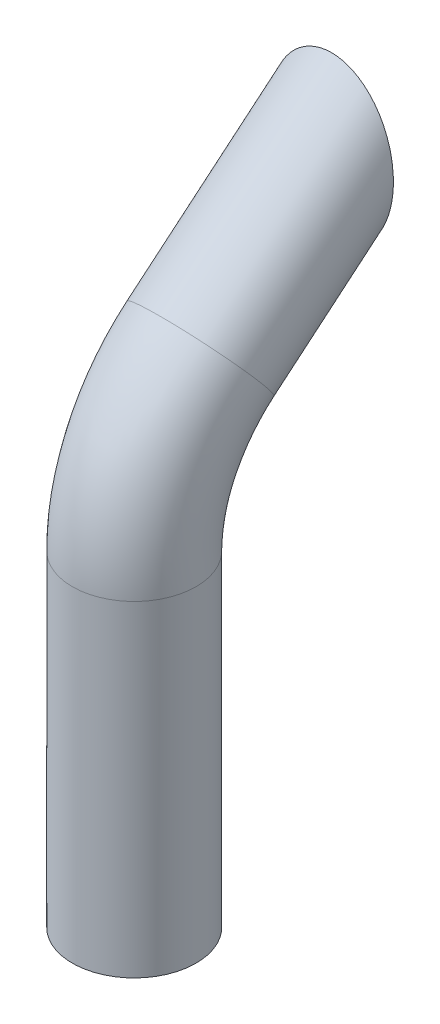
ISO-10303-21;
HEADER;
FILE_DESCRIPTION(('STEP AP214'),'2;1');
FILE_NAME('part.step','',(''),(''),'','','');
FILE_SCHEMA(('AUTOMOTIVE_DESIGN { 1 0 10303 214 1 1 1 1 }'));
ENDSEC;
DATA;
#1=APPLICATION_CONTEXT('core data for automotive mechanical design processes');
#2=APPLICATION_PROTOCOL_DEFINITION('international standard','automotive_design',2000,#1);
#3=PRODUCT_CONTEXT('',#1,'mechanical');
#4=PRODUCT('Part','Part','',(#3));
#5=PRODUCT_RELATED_PRODUCT_CATEGORY('part','',(#4));
#6=PRODUCT_DEFINITION_FORMATION('','',#4);
#7=PRODUCT_DEFINITION_CONTEXT('part definition',#1,'design');
#8=PRODUCT_DEFINITION('design','',#6,#7);
#9=PRODUCT_DEFINITION_SHAPE('','',#8);
#10=(LENGTH_UNIT() NAMED_UNIT(*) SI_UNIT(.MILLI.,.METRE.));
#11=(NAMED_UNIT(*) PLANE_ANGLE_UNIT() SI_UNIT($,.RADIAN.));
#12=(NAMED_UNIT(*) SI_UNIT($,.STERADIAN.) SOLID_ANGLE_UNIT());
#13=UNCERTAINTY_MEASURE_WITH_UNIT(LENGTH_MEASURE(1.E-05),#10,'distance_accuracy_value','');
#14=(GEOMETRIC_REPRESENTATION_CONTEXT(3) GLOBAL_UNCERTAINTY_ASSIGNED_CONTEXT((#13)) GLOBAL_UNIT_ASSIGNED_CONTEXT((#10,
#11,#12)) REPRESENTATION_CONTEXT('',''));
#15=CARTESIAN_POINT('',(0.,0.,0.));
#16=DIRECTION('',(0.,0.,1.));
#17=DIRECTION('',(1.,0.,0.));
#18=AXIS2_PLACEMENT_3D('',#15,#16,#17);
#19=CARTESIAN_POINT('',(0.,-296.418141452981,114.906666467847));
#20=DIRECTION('',(0.,-1.,0.));
#21=DIRECTION('',(0.,0.,-1.));
#22=AXIS2_PLACEMENT_3D('',#19,#20,#21);
#23=PLANE('',#22);
#24=CARTESIAN_POINT('',(0.,-296.418141452981,114.906666467847));
#25=DIRECTION('',(0.,-1.,0.));
#26=DIRECTION('',(0.,0.,-1.));
#27=AXIS2_PLACEMENT_3D('',#24,#25,#26);
#28=CIRCLE('',#27,27.);
#29=CARTESIAN_POINT('',(0.,-296.418141452981,87.9066664678468));
#30=VERTEX_POINT('',#29);
#31=EDGE_CURVE('E56',#30,#30,#28,.T.);
#32=ORIENTED_EDGE('',*,*,#31,.F.);
#33=EDGE_LOOP('',(#32));
#34=FACE_BOUND('',#33,.T.);
#35=CARTESIAN_POINT('',(0.,-296.418141452981,114.906666467847));
#36=DIRECTION('',(0.,-1.,0.));
#37=DIRECTION('',(0.,0.,-1.));
#38=AXIS2_PLACEMENT_3D('',#35,#36,#37);
#39=CIRCLE('',#38,30.);
#40=CARTESIAN_POINT('',(0.,-296.418141452981,84.9066664678468));
#41=VERTEX_POINT('',#40);
#42=EDGE_CURVE('E10',#41,#41,#39,.T.);
#43=ORIENTED_EDGE('',*,*,#42,.T.);
#44=EDGE_LOOP('',(#43));
#45=FACE_BOUND('',#44,.T.);
#46=ADVANCED_FACE('F37',(#34,#45),#23,.T.);
#47=CARTESIAN_POINT('',(0.,0.,0.));
#48=DIRECTION('',(0.,-0.642787609686538,0.766044443118979));
#49=DIRECTION('',(0.,-0.766044443118979,-0.642787609686538));
#50=AXIS2_PLACEMENT_3D('',#47,#48,#49);
#51=CYLINDRICAL_SURFACE('',#50,30.);
#52=CARTESIAN_POINT('',(0.,-16.1808853863989,19.2836282905961));
#53=DIRECTION('',(0.,0.,1.));
#54=DIRECTION('',(0.,-1.,0.));
#55=AXIS2_PLACEMENT_3D('',#52,#53,#54);
#56=ELLIPSE('',#55,39.1622186799683,30.);
#57=CARTESIAN_POINT('',(0.,-55.3431040663672,19.2836282905961));
#58=VERTEX_POINT('',#57);
#59=EDGE_CURVE('E68',#58,#58,#56,.F.);
#60=ORIENTED_EDGE('',*,*,#59,.F.);
#61=EDGE_LOOP('',(#60));
#62=FACE_BOUND('',#61,.T.);
#63=CARTESIAN_POINT('',(0.,-69.4418308062222,82.7575513396349));
#64=DIRECTION('',(0.,-0.642787609686538,0.766044443118979));
#65=DIRECTION('',(0.,-0.766044443118979,-0.642787609686538));
#66=AXIS2_PLACEMENT_3D('',#63,#64,#65);
#67=CIRCLE('',#66,30.);
#68=CARTESIAN_POINT('',(0.,-46.4604975126528,102.041179630231));
#69=VERTEX_POINT('',#68);
#70=EDGE_CURVE('E50',#69,#69,#67,.T.);
#71=ORIENTED_EDGE('',*,*,#70,.F.);
#72=EDGE_LOOP('',(#71));
#73=FACE_BOUND('',#72,.T.);
#74=ADVANCED_FACE('F99',(#62,#73),#51,.T.);
#75=CARTESIAN_POINT('',(0.,-138.385830686931,24.9066664678469));
#76=DIRECTION('',(1.,0.,0.));
#77=DIRECTION('',(0.,0.,-1.));
#78=AXIS2_PLACEMENT_3D('',#75,#76,#77);
#79=TOROIDAL_SURFACE('',#78,90.,30.);
#80=CARTESIAN_POINT('',(0.,-138.385830686931,114.906666467847));
#81=DIRECTION('',(0.,-1.,0.));
#82=DIRECTION('',(0.,0.,-1.));
#83=AXIS2_PLACEMENT_3D('',#80,#81,#82);
#84=CIRCLE('',#83,30.);
#85=CARTESIAN_POINT('',(0.,-138.385830686931,144.906666467847));
#86=VERTEX_POINT('',#85);
#87=EDGE_CURVE('E45',#86,#86,#84,.T.);
#88=CARTESIAN_POINT('',(0.,-138.385830686931,24.9066664678469));
#89=DIRECTION('',(1.,0.,0.));
#90=DIRECTION('',(0.,0.,-1.));
#91=AXIS2_PLACEMENT_3D('',#88,#89,#90);
#92=CIRCLE('',#91,120.);
#93=EDGE_CURVE('',#69,#86,#92,.T.);
#94=ORIENTED_EDGE('',*,*,#70,.T.);
#95=ORIENTED_EDGE('',*,*,#87,.F.);
#96=ORIENTED_EDGE('',*,*,#93,.T.);
#97=ORIENTED_EDGE('',*,*,#93,.F.);
#98=EDGE_LOOP('',(#94,#96,#95,#97));
#99=FACE_BOUND('',#98,.T.);
#100=ADVANCED_FACE('F94',(#99),#79,.T.);
#101=CARTESIAN_POINT('',(0.,-138.385830686931,114.906666467847));
#102=DIRECTION('',(0.,-1.,0.));
#103=DIRECTION('',(0.,0.,-1.));
#104=AXIS2_PLACEMENT_3D('',#101,#102,#103);
#105=CYLINDRICAL_SURFACE('',#104,30.);
#106=ORIENTED_EDGE('',*,*,#42,.F.);
#107=EDGE_LOOP('',(#106));
#108=FACE_BOUND('',#107,.T.);
#109=ORIENTED_EDGE('',*,*,#87,.T.);
#110=EDGE_LOOP('',(#109));
#111=FACE_BOUND('',#110,.T.);
#112=ADVANCED_FACE('F92',(#108,#111),#105,.T.);
#113=CARTESIAN_POINT('',(0.,0.,0.));
#114=DIRECTION('',(0.,-0.642787609686538,0.766044443118979));
#115=DIRECTION('',(0.,-0.766044443118979,-0.642787609686538));
#116=AXIS2_PLACEMENT_3D('',#113,#114,#115);
#117=CYLINDRICAL_SURFACE('',#116,27.);
#118=CARTESIAN_POINT('',(0.,-16.1808853863989,19.2836282905961));
#119=DIRECTION('',(0.,0.,1.));
#120=DIRECTION('',(0.,-1.,0.));
#121=AXIS2_PLACEMENT_3D('',#118,#119,#120);
#122=ELLIPSE('',#121,35.2459968119715,27.);
#123=CARTESIAN_POINT('',(0.,-51.4268821983704,19.2836282905961));
#124=VERTEX_POINT('',#123);
#125=EDGE_CURVE('E40',#124,#124,#122,.F.);
#126=ORIENTED_EDGE('',*,*,#125,.T.);
#127=EDGE_LOOP('',(#126));
#128=FACE_BOUND('',#127,.T.);
#129=CARTESIAN_POINT('',(0.,-69.4418308062223,82.757551339635));
#130=DIRECTION('',(0.,0.642787609686535,-0.766044443118982));
#131=DIRECTION('',(0.,0.766044443118982,0.642787609686535));
#132=AXIS2_PLACEMENT_3D('',#129,#130,#131);
#133=CIRCLE('',#132,27.);
#134=CARTESIAN_POINT('',(0.,-48.7586308420098,100.112816801171));
#135=VERTEX_POINT('',#134);
#136=EDGE_CURVE('E64',#135,#135,#133,.F.);
#137=ORIENTED_EDGE('',*,*,#136,.T.);
#138=EDGE_LOOP('',(#137));
#139=FACE_BOUND('',#138,.T.);
#140=ADVANCED_FACE('F77',(#128,#139),#117,.F.);
#141=CARTESIAN_POINT('',(0.,-138.385830686931,24.9066664678469));
#142=DIRECTION('',(1.,0.,0.));
#143=DIRECTION('',(0.,0.,-1.));
#144=AXIS2_PLACEMENT_3D('',#141,#142,#143);
#145=TOROIDAL_SURFACE('',#144,90.,27.);
#146=CARTESIAN_POINT('',(0.,-138.385830686931,114.906666467847));
#147=DIRECTION('',(0.,-1.,0.));
#148=DIRECTION('',(0.,0.,-1.));
#149=AXIS2_PLACEMENT_3D('',#146,#147,#148);
#150=CIRCLE('',#149,27.);
#151=CARTESIAN_POINT('',(0.,-138.385830686931,141.906666467847));
#152=VERTEX_POINT('',#151);
#153=EDGE_CURVE('E60',#152,#152,#150,.T.);
#154=CARTESIAN_POINT('',(0.,-138.385830686931,24.9066664678469));
#155=DIRECTION('',(1.,0.,0.));
#156=DIRECTION('',(0.,0.,-1.));
#157=AXIS2_PLACEMENT_3D('',#154,#155,#156);
#158=CIRCLE('',#157,117.);
#159=EDGE_CURVE('',#135,#152,#158,.T.);
#160=ORIENTED_EDGE('',*,*,#136,.F.);
#161=ORIENTED_EDGE('',*,*,#153,.T.);
#162=ORIENTED_EDGE('',*,*,#159,.T.);
#163=ORIENTED_EDGE('',*,*,#159,.F.);
#164=EDGE_LOOP('',(#160,#162,#161,#163));
#165=FACE_BOUND('',#164,.T.);
#166=ADVANCED_FACE('F87',(#165),#145,.F.);
#167=CARTESIAN_POINT('',(0.,-138.385830686931,114.906666467847));
#168=DIRECTION('',(0.,-1.,0.));
#169=DIRECTION('',(0.,0.,-1.));
#170=AXIS2_PLACEMENT_3D('',#167,#168,#169);
#171=CYLINDRICAL_SURFACE('',#170,27.);
#172=ORIENTED_EDGE('',*,*,#31,.T.);
#173=EDGE_LOOP('',(#172));
#174=FACE_BOUND('',#173,.T.);
#175=ORIENTED_EDGE('',*,*,#153,.F.);
#176=EDGE_LOOP('',(#175));
#177=FACE_BOUND('',#176,.T.);
#178=ADVANCED_FACE('F82',(#174,#177),#171,.F.);
#179=CARTESIAN_POINT('',(-45.,22.9813332935694,19.2836282905961));
#180=DIRECTION('',(0.,0.,1.));
#181=DIRECTION('',(1.,0.,0.));
#182=AXIS2_PLACEMENT_3D('',#179,#180,#181);
#183=PLANE('',#182);
#184=ORIENTED_EDGE('',*,*,#59,.T.);
#185=EDGE_LOOP('',(#184));
#186=FACE_BOUND('',#185,.T.);
#187=ORIENTED_EDGE('',*,*,#125,.F.);
#188=EDGE_LOOP('',(#187));
#189=FACE_BOUND('',#188,.T.);
#190=ADVANCED_FACE('F80',(#186,#189),#183,.F.);
#191=CLOSED_SHELL('',(#46,#74,#100,#112,#140,#166,#178,#190));
#192=MANIFOLD_SOLID_BREP('B2',#191);
#193=ADVANCED_BREP_SHAPE_REPRESENTATION('',(#18,#192),#14);
#194=SHAPE_DEFINITION_REPRESENTATION(#9,#193);
ENDSEC;
END-ISO-10303-21;
